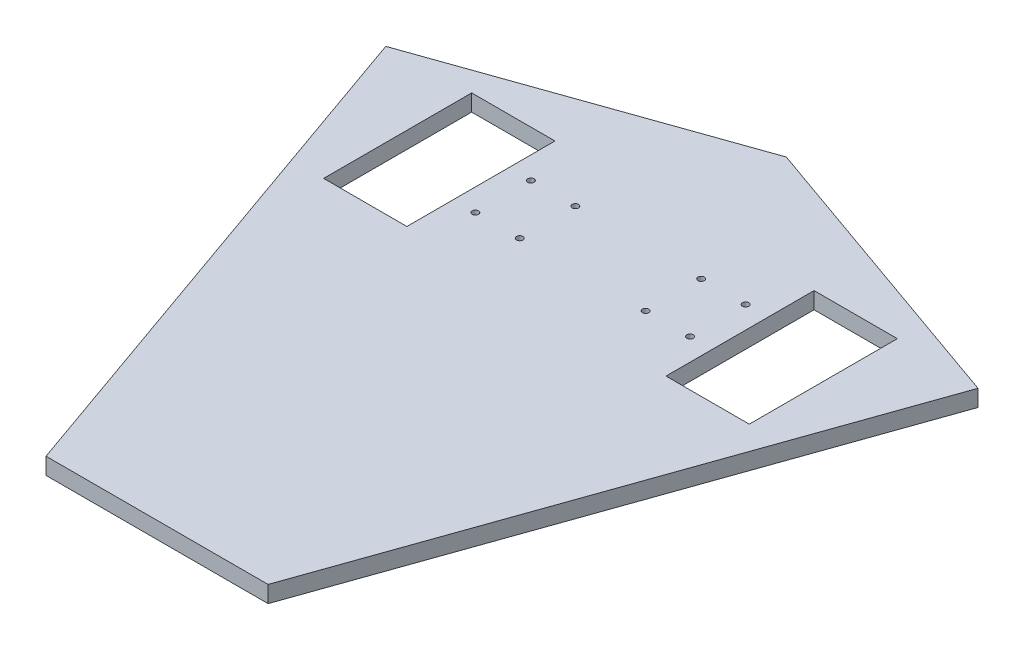
ISO-10303-21;
HEADER;
FILE_DESCRIPTION(('STEP AP214'),'2;1');
FILE_NAME('part.step','',(''),(''),'','','');
FILE_SCHEMA(('AUTOMOTIVE_DESIGN { 1 0 10303 214 1 1 1 1 }'));
ENDSEC;
DATA;
#1=APPLICATION_CONTEXT('core data for automotive mechanical design processes');
#2=APPLICATION_PROTOCOL_DEFINITION('international standard','automotive_design',2000,#1);
#3=PRODUCT_CONTEXT('',#1,'mechanical');
#4=PRODUCT('Part','Part','',(#3));
#5=PRODUCT_RELATED_PRODUCT_CATEGORY('part','',(#4));
#6=PRODUCT_DEFINITION_FORMATION('','',#4);
#7=PRODUCT_DEFINITION_CONTEXT('part definition',#1,'design');
#8=PRODUCT_DEFINITION('design','',#6,#7);
#9=PRODUCT_DEFINITION_SHAPE('','',#8);
#10=(LENGTH_UNIT() NAMED_UNIT(*) SI_UNIT(.MILLI.,.METRE.));
#11=(NAMED_UNIT(*) PLANE_ANGLE_UNIT() SI_UNIT($,.RADIAN.));
#12=(NAMED_UNIT(*) SI_UNIT($,.STERADIAN.) SOLID_ANGLE_UNIT());
#13=UNCERTAINTY_MEASURE_WITH_UNIT(LENGTH_MEASURE(1.E-05),#10,'distance_accuracy_value','');
#14=(GEOMETRIC_REPRESENTATION_CONTEXT(3) GLOBAL_UNCERTAINTY_ASSIGNED_CONTEXT((#13)) GLOBAL_UNIT_ASSIGNED_CONTEXT((#10,
#11,#12)) REPRESENTATION_CONTEXT('',''));
#15=CARTESIAN_POINT('',(0.,0.,0.));
#16=DIRECTION('',(0.,0.,1.));
#17=DIRECTION('',(1.,0.,0.));
#18=AXIS2_PLACEMENT_3D('',#15,#16,#17);
#19=CARTESIAN_POINT('',(0.,0.,0.));
#20=DIRECTION('',(0.,-1.,0.));
#21=DIRECTION('',(0.,0.,-1.));
#22=AXIS2_PLACEMENT_3D('',#19,#20,#21);
#23=PLANE('',#22);
#24=CARTESIAN_POINT('',(58.,0.,-30.));
#25=DIRECTION('',(0.,1.,0.));
#26=DIRECTION('',(0.,0.,1.));
#27=AXIS2_PLACEMENT_3D('',#24,#25,#26);
#28=CIRCLE('',#27,1.69999999999999);
#29=CARTESIAN_POINT('',(58.,0.,-28.3));
#30=VERTEX_POINT('',#29);
#31=EDGE_CURVE('E280',#30,#30,#28,.T.);
#32=ORIENTED_EDGE('',*,*,#31,.F.);
#33=EDGE_LOOP('',(#32));
#34=FACE_BOUND('',#33,.T.);
#35=CARTESIAN_POINT('',(34.,0.,-30.));
#36=DIRECTION('',(0.,1.,0.));
#37=DIRECTION('',(0.,0.,1.));
#38=AXIS2_PLACEMENT_3D('',#35,#36,#37);
#39=CIRCLE('',#38,1.69999999999999);
#40=CARTESIAN_POINT('',(34.,0.,-28.3));
#41=VERTEX_POINT('',#40);
#42=EDGE_CURVE('E274',#41,#41,#39,.T.);
#43=ORIENTED_EDGE('',*,*,#42,.F.);
#44=EDGE_LOOP('',(#43));
#45=FACE_BOUND('',#44,.T.);
#46=CARTESIAN_POINT('',(-58.,0.,-30.));
#47=DIRECTION('',(0.,1.,0.));
#48=DIRECTION('',(0.,0.,1.));
#49=AXIS2_PLACEMENT_3D('',#46,#47,#48);
#50=CIRCLE('',#49,1.69999999999999);
#51=CARTESIAN_POINT('',(-58.,0.,-28.3));
#52=VERTEX_POINT('',#51);
#53=EDGE_CURVE('E271',#52,#52,#50,.T.);
#54=ORIENTED_EDGE('',*,*,#53,.F.);
#55=EDGE_LOOP('',(#54));
#56=FACE_BOUND('',#55,.T.);
#57=CARTESIAN_POINT('',(-58.,0.,0.));
#58=DIRECTION('',(0.,1.,0.));
#59=DIRECTION('',(0.,0.,1.));
#60=AXIS2_PLACEMENT_3D('',#57,#58,#59);
#61=CIRCLE('',#60,1.69999999999999);
#62=CARTESIAN_POINT('',(-58.,0.,1.7));
#63=VERTEX_POINT('',#62);
#64=EDGE_CURVE('E257',#63,#63,#61,.T.);
#65=ORIENTED_EDGE('',*,*,#64,.F.);
#66=EDGE_LOOP('',(#65));
#67=FACE_BOUND('',#66,.T.);
#68=CARTESIAN_POINT('',(-34.,0.,0.));
#69=DIRECTION('',(0.,1.,0.));
#70=DIRECTION('',(0.,0.,1.));
#71=AXIS2_PLACEMENT_3D('',#68,#69,#70);
#72=CIRCLE('',#71,1.69999999999999);
#73=CARTESIAN_POINT('',(-34.,0.,1.69999999999999));
#74=VERTEX_POINT('',#73);
#75=EDGE_CURVE('E248',#74,#74,#72,.T.);
#76=ORIENTED_EDGE('',*,*,#75,.F.);
#77=EDGE_LOOP('',(#76));
#78=FACE_BOUND('',#77,.T.);
#79=DIRECTION('',(-0.943080490559088,0.,-0.332564562644353));
#80=VECTOR('',#79,1.);
#81=CARTESIAN_POINT('',(0.,0.,-110.));
#82=LINE('',#81,#80);
#83=CARTESIAN_POINT('',(160.,0.,-53.5781669160055));
#84=VERTEX_POINT('',#83);
#85=CARTESIAN_POINT('',(0.,0.,-110.));
#86=VERTEX_POINT('',#85);
#87=EDGE_CURVE('E210',#84,#86,#82,.T.);
#88=ORIENTED_EDGE('',*,*,#87,.T.);
#89=DIRECTION('',(-0.943080490559088,0.,0.332564562644353));
#90=VECTOR('',#89,1.);
#91=CARTESIAN_POINT('',(0.,0.,-110.));
#92=LINE('',#91,#90);
#93=CARTESIAN_POINT('',(-160.,0.,-53.5781669160055));
#94=VERTEX_POINT('',#93);
#95=EDGE_CURVE('E230',#86,#94,#92,.T.);
#96=ORIENTED_EDGE('',*,*,#95,.T.);
#97=DIRECTION('',(0.332564562644353,0.,0.943080490559088));
#98=VECTOR('',#97,1.);
#99=CARTESIAN_POINT('',(-160.,0.,-53.5781669160055));
#100=LINE('',#99,#98);
#101=CARTESIAN_POINT('',(-60.,0.,230.));
#102=VERTEX_POINT('',#101);
#103=EDGE_CURVE('E233',#94,#102,#100,.T.);
#104=ORIENTED_EDGE('',*,*,#103,.T.);
#105=DIRECTION('',(1.,0.,0.));
#106=VECTOR('',#105,1.);
#107=CARTESIAN_POINT('',(-60.,0.,230.));
#108=LINE('',#107,#106);
#109=CARTESIAN_POINT('',(60.,0.,230.));
#110=VERTEX_POINT('',#109);
#111=EDGE_CURVE('E236',#102,#110,#108,.T.);
#112=ORIENTED_EDGE('',*,*,#111,.T.);
#113=DIRECTION('',(0.332564562644353,0.,-0.943080490559088));
#114=VECTOR('',#113,1.);
#115=CARTESIAN_POINT('',(160.,0.,-53.5781669160055));
#116=LINE('',#115,#114);
#117=EDGE_CURVE('E215',#110,#84,#116,.T.);
#118=ORIENTED_EDGE('',*,*,#117,.T.);
#119=EDGE_LOOP('',(#88,#96,#104,#112,#118));
#120=FACE_BOUND('',#119,.T.);
#121=DIRECTION('',(1.,0.,0.));
#122=VECTOR('',#121,1.);
#123=CARTESIAN_POINT('',(-115.,0.,25.));
#124=LINE('',#123,#122);
#125=CARTESIAN_POINT('',(-115.,0.,25.));
#126=VERTEX_POINT('',#125);
#127=CARTESIAN_POINT('',(-70.,0.,25.));
#128=VERTEX_POINT('',#127);
#129=EDGE_CURVE('E189',#126,#128,#124,.T.);
#130=ORIENTED_EDGE('',*,*,#129,.F.);
#131=DIRECTION('',(0.,0.,1.));
#132=VECTOR('',#131,1.);
#133=CARTESIAN_POINT('',(-115.,0.,-55.));
#134=LINE('',#133,#132);
#135=CARTESIAN_POINT('',(-115.,0.,-55.));
#136=VERTEX_POINT('',#135);
#137=EDGE_CURVE('E187',#136,#126,#134,.T.);
#138=ORIENTED_EDGE('',*,*,#137,.F.);
#139=DIRECTION('',(-1.,0.,0.));
#140=VECTOR('',#139,1.);
#141=CARTESIAN_POINT('',(-115.,0.,-55.));
#142=LINE('',#141,#140);
#143=CARTESIAN_POINT('',(-70.,0.,-55.));
#144=VERTEX_POINT('',#143);
#145=EDGE_CURVE('E195',#144,#136,#142,.T.);
#146=ORIENTED_EDGE('',*,*,#145,.F.);
#147=DIRECTION('',(0.,0.,-1.));
#148=VECTOR('',#147,1.);
#149=CARTESIAN_POINT('',(-70.,0.,-55.));
#150=LINE('',#149,#148);
#151=EDGE_CURVE('E192',#128,#144,#150,.T.);
#152=ORIENTED_EDGE('',*,*,#151,.F.);
#153=EDGE_LOOP('',(#130,#138,#146,#152));
#154=FACE_BOUND('',#153,.T.);
#155=DIRECTION('',(0.,0.,1.));
#156=VECTOR('',#155,1.);
#157=CARTESIAN_POINT('',(115.,0.,-55.));
#158=LINE('',#157,#156);
#159=CARTESIAN_POINT('',(115.,0.,-55.));
#160=VERTEX_POINT('',#159);
#161=CARTESIAN_POINT('',(115.,0.,25.));
#162=VERTEX_POINT('',#161);
#163=EDGE_CURVE('E72',#160,#162,#158,.T.);
#164=ORIENTED_EDGE('',*,*,#163,.T.);
#165=DIRECTION('',(-1.,0.,0.));
#166=VECTOR('',#165,1.);
#167=CARTESIAN_POINT('',(115.,0.,25.));
#168=LINE('',#167,#166);
#169=CARTESIAN_POINT('',(70.,0.,25.));
#170=VERTEX_POINT('',#169);
#171=EDGE_CURVE('E151',#162,#170,#168,.T.);
#172=ORIENTED_EDGE('',*,*,#171,.T.);
#173=DIRECTION('',(0.,0.,-1.));
#174=VECTOR('',#173,1.);
#175=CARTESIAN_POINT('',(70.,0.,-55.));
#176=LINE('',#175,#174);
#177=CARTESIAN_POINT('',(70.,0.,-55.));
#178=VERTEX_POINT('',#177);
#179=EDGE_CURVE('E170',#170,#178,#176,.T.);
#180=ORIENTED_EDGE('',*,*,#179,.T.);
#181=DIRECTION('',(1.,0.,0.));
#182=VECTOR('',#181,1.);
#183=CARTESIAN_POINT('',(115.,0.,-55.));
#184=LINE('',#183,#182);
#185=EDGE_CURVE('E164',#178,#160,#184,.T.);
#186=ORIENTED_EDGE('',*,*,#185,.T.);
#187=EDGE_LOOP('',(#164,#172,#180,#186));
#188=FACE_BOUND('',#187,.T.);
#189=CARTESIAN_POINT('',(-34.,0.,-30.));
#190=DIRECTION('',(0.,1.,0.));
#191=DIRECTION('',(0.,0.,1.));
#192=AXIS2_PLACEMENT_3D('',#189,#190,#191);
#193=CIRCLE('',#192,1.69999999999999);
#194=CARTESIAN_POINT('',(-34.,0.,-28.3));
#195=VERTEX_POINT('',#194);
#196=EDGE_CURVE('E265',#195,#195,#193,.T.);
#197=ORIENTED_EDGE('',*,*,#196,.F.);
#198=EDGE_LOOP('',(#197));
#199=FACE_BOUND('',#198,.T.);
#200=CARTESIAN_POINT('',(34.,0.,0.));
#201=DIRECTION('',(0.,1.,0.));
#202=DIRECTION('',(0.,0.,1.));
#203=AXIS2_PLACEMENT_3D('',#200,#201,#202);
#204=CIRCLE('',#203,1.69999999999999);
#205=CARTESIAN_POINT('',(34.,0.,1.69999999999999));
#206=VERTEX_POINT('',#205);
#207=EDGE_CURVE('E286',#206,#206,#204,.T.);
#208=ORIENTED_EDGE('',*,*,#207,.F.);
#209=EDGE_LOOP('',(#208));
#210=FACE_BOUND('',#209,.T.);
#211=CARTESIAN_POINT('',(58.,0.,0.));
#212=DIRECTION('',(0.,1.,0.));
#213=DIRECTION('',(0.,0.,1.));
#214=AXIS2_PLACEMENT_3D('',#211,#212,#213);
#215=CIRCLE('',#214,1.69999999999999);
#216=CARTESIAN_POINT('',(58.,0.,1.7));
#217=VERTEX_POINT('',#216);
#218=EDGE_CURVE('E292',#217,#217,#215,.T.);
#219=ORIENTED_EDGE('',*,*,#218,.F.);
#220=EDGE_LOOP('',(#219));
#221=FACE_BOUND('',#220,.T.);
#222=ADVANCED_FACE('F47',(#34,#45,#56,#67,#78,#120,#154,#188,#199,#210,#221),#23,.F.);
#223=CARTESIAN_POINT('',(0.,-9.,0.));
#224=DIRECTION('',(0.,-1.,0.));
#225=DIRECTION('',(0.,0.,-1.));
#226=AXIS2_PLACEMENT_3D('',#223,#224,#225);
#227=PLANE('',#226);
#228=CARTESIAN_POINT('',(58.,-9.,0.));
#229=DIRECTION('',(0.,-1.,0.));
#230=DIRECTION('',(0.,0.,-1.));
#231=AXIS2_PLACEMENT_3D('',#228,#229,#230);
#232=CIRCLE('',#231,1.69999999999999);
#233=CARTESIAN_POINT('',(58.,-9.,-1.69999999999999));
#234=VERTEX_POINT('',#233);
#235=EDGE_CURVE('E289',#234,#234,#232,.T.);
#236=ORIENTED_EDGE('',*,*,#235,.F.);
#237=EDGE_LOOP('',(#236));
#238=FACE_BOUND('',#237,.T.);
#239=CARTESIAN_POINT('',(34.,-9.,0.));
#240=DIRECTION('',(0.,-1.,0.));
#241=DIRECTION('',(0.,0.,-1.));
#242=AXIS2_PLACEMENT_3D('',#239,#240,#241);
#243=CIRCLE('',#242,1.69999999999999);
#244=CARTESIAN_POINT('',(34.,-9.,-1.69999999999999));
#245=VERTEX_POINT('',#244);
#246=EDGE_CURVE('E283',#245,#245,#243,.T.);
#247=ORIENTED_EDGE('',*,*,#246,.F.);
#248=EDGE_LOOP('',(#247));
#249=FACE_BOUND('',#248,.T.);
#250=CARTESIAN_POINT('',(58.,-9.,-30.));
#251=DIRECTION('',(0.,-1.,0.));
#252=DIRECTION('',(0.,0.,-1.));
#253=AXIS2_PLACEMENT_3D('',#250,#251,#252);
#254=CIRCLE('',#253,1.69999999999999);
#255=CARTESIAN_POINT('',(58.,-9.,-31.7));
#256=VERTEX_POINT('',#255);
#257=EDGE_CURVE('E277',#256,#256,#254,.T.);
#258=ORIENTED_EDGE('',*,*,#257,.F.);
#259=EDGE_LOOP('',(#258));
#260=FACE_BOUND('',#259,.T.);
#261=CARTESIAN_POINT('',(34.,-9.,-30.));
#262=DIRECTION('',(0.,-1.,0.));
#263=DIRECTION('',(0.,0.,-1.));
#264=AXIS2_PLACEMENT_3D('',#261,#262,#263);
#265=CIRCLE('',#264,1.69999999999999);
#266=CARTESIAN_POINT('',(34.,-9.,-31.7));
#267=VERTEX_POINT('',#266);
#268=EDGE_CURVE('E51',#267,#267,#265,.T.);
#269=ORIENTED_EDGE('',*,*,#268,.F.);
#270=EDGE_LOOP('',(#269));
#271=FACE_BOUND('',#270,.T.);
#272=CARTESIAN_POINT('',(-58.,-9.,-30.));
#273=DIRECTION('',(0.,-1.,0.));
#274=DIRECTION('',(0.,0.,-1.));
#275=AXIS2_PLACEMENT_3D('',#272,#273,#274);
#276=CIRCLE('',#275,1.69999999999999);
#277=CARTESIAN_POINT('',(-58.,-9.,-31.7));
#278=VERTEX_POINT('',#277);
#279=EDGE_CURVE('E268',#278,#278,#276,.T.);
#280=ORIENTED_EDGE('',*,*,#279,.F.);
#281=EDGE_LOOP('',(#280));
#282=FACE_BOUND('',#281,.T.);
#283=CARTESIAN_POINT('',(-34.,-9.,-30.));
#284=DIRECTION('',(0.,-1.,0.));
#285=DIRECTION('',(0.,0.,-1.));
#286=AXIS2_PLACEMENT_3D('',#283,#284,#285);
#287=CIRCLE('',#286,1.69999999999999);
#288=CARTESIAN_POINT('',(-34.,-9.,-31.7));
#289=VERTEX_POINT('',#288);
#290=EDGE_CURVE('E262',#289,#289,#287,.T.);
#291=ORIENTED_EDGE('',*,*,#290,.F.);
#292=EDGE_LOOP('',(#291));
#293=FACE_BOUND('',#292,.T.);
#294=CARTESIAN_POINT('',(-58.,-9.,0.));
#295=DIRECTION('',(0.,-1.,0.));
#296=DIRECTION('',(0.,0.,-1.));
#297=AXIS2_PLACEMENT_3D('',#294,#295,#296);
#298=CIRCLE('',#297,1.69999999999999);
#299=CARTESIAN_POINT('',(-58.,-9.,-1.69999999999999));
#300=VERTEX_POINT('',#299);
#301=EDGE_CURVE('E252',#300,#300,#298,.T.);
#302=ORIENTED_EDGE('',*,*,#301,.F.);
#303=EDGE_LOOP('',(#302));
#304=FACE_BOUND('',#303,.T.);
#305=CARTESIAN_POINT('',(-34.,-9.,0.));
#306=DIRECTION('',(0.,-1.,0.));
#307=DIRECTION('',(0.,0.,-1.));
#308=AXIS2_PLACEMENT_3D('',#305,#306,#307);
#309=CIRCLE('',#308,1.69999999999999);
#310=CARTESIAN_POINT('',(-34.,-9.,-1.69999999999999));
#311=VERTEX_POINT('',#310);
#312=EDGE_CURVE('E246',#311,#311,#309,.T.);
#313=ORIENTED_EDGE('',*,*,#312,.F.);
#314=EDGE_LOOP('',(#313));
#315=FACE_BOUND('',#314,.T.);
#316=DIRECTION('',(0.,0.,1.));
#317=VECTOR('',#316,1.);
#318=CARTESIAN_POINT('',(-115.,-9.,-55.));
#319=LINE('',#318,#317);
#320=CARTESIAN_POINT('',(-115.,-9.,-55.));
#321=VERTEX_POINT('',#320);
#322=CARTESIAN_POINT('',(-115.,-9.,25.));
#323=VERTEX_POINT('',#322);
#324=EDGE_CURVE('E184',#321,#323,#319,.T.);
#325=ORIENTED_EDGE('',*,*,#324,.T.);
#326=DIRECTION('',(1.,0.,0.));
#327=VECTOR('',#326,1.);
#328=CARTESIAN_POINT('',(-115.,-9.,25.));
#329=LINE('',#328,#327);
#330=CARTESIAN_POINT('',(-70.,-9.,25.));
#331=VERTEX_POINT('',#330);
#332=EDGE_CURVE('E201',#323,#331,#329,.T.);
#333=ORIENTED_EDGE('',*,*,#332,.T.);
#334=DIRECTION('',(0.,0.,-1.));
#335=VECTOR('',#334,1.);
#336=CARTESIAN_POINT('',(-70.,-9.,-55.));
#337=LINE('',#336,#335);
#338=CARTESIAN_POINT('',(-70.,-9.,-55.));
#339=VERTEX_POINT('',#338);
#340=EDGE_CURVE('E157',#331,#339,#337,.T.);
#341=ORIENTED_EDGE('',*,*,#340,.T.);
#342=DIRECTION('',(-1.,0.,0.));
#343=VECTOR('',#342,1.);
#344=CARTESIAN_POINT('',(-115.,-9.,-55.));
#345=LINE('',#344,#343);
#346=EDGE_CURVE('E181',#339,#321,#345,.T.);
#347=ORIENTED_EDGE('',*,*,#346,.T.);
#348=EDGE_LOOP('',(#325,#333,#341,#347));
#349=FACE_BOUND('',#348,.T.);
#350=DIRECTION('',(-0.943080490559088,0.,-0.332564562644353));
#351=VECTOR('',#350,1.);
#352=CARTESIAN_POINT('',(0.,-9.,-110.));
#353=LINE('',#352,#351);
#354=CARTESIAN_POINT('',(160.,-9.,-53.5781669160055));
#355=VERTEX_POINT('',#354);
#356=CARTESIAN_POINT('',(0.,-9.,-110.));
#357=VERTEX_POINT('',#356);
#358=EDGE_CURVE('E211',#355,#357,#353,.T.);
#359=ORIENTED_EDGE('',*,*,#358,.F.);
#360=DIRECTION('',(0.332564562644353,0.,-0.943080490559088));
#361=VECTOR('',#360,1.);
#362=CARTESIAN_POINT('',(160.,-9.,-53.5781669160055));
#363=LINE('',#362,#361);
#364=CARTESIAN_POINT('',(60.,-9.,230.));
#365=VERTEX_POINT('',#364);
#366=EDGE_CURVE('E224',#365,#355,#363,.T.);
#367=ORIENTED_EDGE('',*,*,#366,.F.);
#368=DIRECTION('',(1.,0.,0.));
#369=VECTOR('',#368,1.);
#370=CARTESIAN_POINT('',(-60.,-9.,230.));
#371=LINE('',#370,#369);
#372=CARTESIAN_POINT('',(-60.,-9.,230.));
#373=VERTEX_POINT('',#372);
#374=EDGE_CURVE('E221',#373,#365,#371,.T.);
#375=ORIENTED_EDGE('',*,*,#374,.F.);
#376=DIRECTION('',(0.332564562644353,0.,0.943080490559088));
#377=VECTOR('',#376,1.);
#378=CARTESIAN_POINT('',(-160.,-9.,-53.5781669160055));
#379=LINE('',#378,#377);
#380=CARTESIAN_POINT('',(-160.,-9.,-53.5781669160055));
#381=VERTEX_POINT('',#380);
#382=EDGE_CURVE('E218',#381,#373,#379,.T.);
#383=ORIENTED_EDGE('',*,*,#382,.F.);
#384=DIRECTION('',(-0.943080490559088,0.,0.332564562644353));
#385=VECTOR('',#384,1.);
#386=CARTESIAN_POINT('',(0.,-9.,-110.));
#387=LINE('',#386,#385);
#388=EDGE_CURVE('E214',#357,#381,#387,.T.);
#389=ORIENTED_EDGE('',*,*,#388,.F.);
#390=EDGE_LOOP('',(#359,#367,#375,#383,#389));
#391=FACE_BOUND('',#390,.T.);
#392=DIRECTION('',(-1.,0.,0.));
#393=VECTOR('',#392,1.);
#394=CARTESIAN_POINT('',(115.,-9.,25.));
#395=LINE('',#394,#393);
#396=CARTESIAN_POINT('',(115.,-9.,25.));
#397=VERTEX_POINT('',#396);
#398=CARTESIAN_POINT('',(70.,-9.,25.));
#399=VERTEX_POINT('',#398);
#400=EDGE_CURVE('E162',#397,#399,#395,.T.);
#401=ORIENTED_EDGE('',*,*,#400,.F.);
#402=DIRECTION('',(0.,0.,1.));
#403=VECTOR('',#402,1.);
#404=CARTESIAN_POINT('',(115.,-9.,-55.));
#405=LINE('',#404,#403);
#406=CARTESIAN_POINT('',(115.,-9.,-55.));
#407=VERTEX_POINT('',#406);
#408=EDGE_CURVE('E145',#407,#397,#405,.T.);
#409=ORIENTED_EDGE('',*,*,#408,.F.);
#410=DIRECTION('',(1.,0.,0.));
#411=VECTOR('',#410,1.);
#412=CARTESIAN_POINT('',(115.,-9.,-55.));
#413=LINE('',#412,#411);
#414=CARTESIAN_POINT('',(70.,-9.,-55.));
#415=VERTEX_POINT('',#414);
#416=EDGE_CURVE('E154',#415,#407,#413,.T.);
#417=ORIENTED_EDGE('',*,*,#416,.F.);
#418=DIRECTION('',(0.,0.,-1.));
#419=VECTOR('',#418,1.);
#420=CARTESIAN_POINT('',(70.,-9.,-55.));
#421=LINE('',#420,#419);
#422=EDGE_CURVE('E64',#399,#415,#421,.T.);
#423=ORIENTED_EDGE('',*,*,#422,.F.);
#424=EDGE_LOOP('',(#401,#409,#417,#423));
#425=FACE_BOUND('',#424,.T.);
#426=ADVANCED_FACE('F160',(#238,#249,#260,#271,#282,#293,#304,#315,#349,#391,#425),#227,.T.);
#427=CARTESIAN_POINT('',(0.,-9.,-110.));
#428=DIRECTION('',(0.332564562644353,0.,-0.943080490559088));
#429=DIRECTION('',(-0.943080490559088,0.,-0.332564562644353));
#430=AXIS2_PLACEMENT_3D('',#427,#428,#429);
#431=PLANE('',#430);
#432=ORIENTED_EDGE('',*,*,#87,.F.);
#433=DIRECTION('',(0.,1.,0.));
#434=VECTOR('',#433,1.);
#435=CARTESIAN_POINT('',(160.,-9.,-53.5781669160055));
#436=LINE('',#435,#434);
#437=EDGE_CURVE('E13',#355,#84,#436,.T.);
#438=ORIENTED_EDGE('',*,*,#437,.F.);
#439=ORIENTED_EDGE('',*,*,#358,.T.);
#440=DIRECTION('',(0.,1.,0.));
#441=VECTOR('',#440,1.);
#442=CARTESIAN_POINT('',(0.,-9.,-110.));
#443=LINE('',#442,#441);
#444=EDGE_CURVE('E227',#357,#86,#443,.T.);
#445=ORIENTED_EDGE('',*,*,#444,.T.);
#446=EDGE_LOOP('',(#432,#438,#439,#445));
#447=FACE_BOUND('',#446,.T.);
#448=ADVANCED_FACE('F49',(#447),#431,.T.);
#449=CARTESIAN_POINT('',(160.,-9.,-53.5781669160055));
#450=DIRECTION('',(0.943080490559088,0.,0.332564562644353));
#451=DIRECTION('',(0.332564562644353,0.,-0.943080490559088));
#452=AXIS2_PLACEMENT_3D('',#449,#450,#451);
#453=PLANE('',#452);
#454=ORIENTED_EDGE('',*,*,#117,.F.);
#455=DIRECTION('',(0.,1.,0.));
#456=VECTOR('',#455,1.);
#457=CARTESIAN_POINT('',(60.,-9.,230.));
#458=LINE('',#457,#456);
#459=EDGE_CURVE('E56',#365,#110,#458,.T.);
#460=ORIENTED_EDGE('',*,*,#459,.F.);
#461=ORIENTED_EDGE('',*,*,#366,.T.);
#462=ORIENTED_EDGE('',*,*,#437,.T.);
#463=EDGE_LOOP('',(#454,#460,#461,#462));
#464=FACE_BOUND('',#463,.T.);
#465=ADVANCED_FACE('F310',(#464),#453,.T.);
#466=CARTESIAN_POINT('',(-60.,-9.,230.));
#467=DIRECTION('',(0.,0.,1.));
#468=DIRECTION('',(1.,0.,0.));
#469=AXIS2_PLACEMENT_3D('',#466,#467,#468);
#470=PLANE('',#469);
#471=ORIENTED_EDGE('',*,*,#111,.F.);
#472=DIRECTION('',(0.,1.,0.));
#473=VECTOR('',#472,1.);
#474=CARTESIAN_POINT('',(-60.,-9.,230.));
#475=LINE('',#474,#473);
#476=EDGE_CURVE('E242',#373,#102,#475,.T.);
#477=ORIENTED_EDGE('',*,*,#476,.F.);
#478=ORIENTED_EDGE('',*,*,#374,.T.);
#479=ORIENTED_EDGE('',*,*,#459,.T.);
#480=EDGE_LOOP('',(#471,#477,#478,#479));
#481=FACE_BOUND('',#480,.T.);
#482=ADVANCED_FACE('F313',(#481),#470,.T.);
#483=CARTESIAN_POINT('',(-160.,-9.,-53.5781669160055));
#484=DIRECTION('',(-0.943080490559088,0.,0.332564562644353));
#485=DIRECTION('',(0.332564562644353,0.,0.943080490559088));
#486=AXIS2_PLACEMENT_3D('',#483,#484,#485);
#487=PLANE('',#486);
#488=ORIENTED_EDGE('',*,*,#103,.F.);
#489=DIRECTION('',(0.,1.,0.));
#490=VECTOR('',#489,1.);
#491=CARTESIAN_POINT('',(-160.,-9.,-53.5781669160055));
#492=LINE('',#491,#490);
#493=EDGE_CURVE('E244',#381,#94,#492,.T.);
#494=ORIENTED_EDGE('',*,*,#493,.F.);
#495=ORIENTED_EDGE('',*,*,#382,.T.);
#496=ORIENTED_EDGE('',*,*,#476,.T.);
#497=EDGE_LOOP('',(#488,#494,#495,#496));
#498=FACE_BOUND('',#497,.T.);
#499=ADVANCED_FACE('F317',(#498),#487,.T.);
#500=CARTESIAN_POINT('',(0.,-9.,-110.));
#501=DIRECTION('',(-0.332564562644353,0.,-0.943080490559088));
#502=DIRECTION('',(-0.943080490559088,0.,0.332564562644353));
#503=AXIS2_PLACEMENT_3D('',#500,#501,#502);
#504=PLANE('',#503);
#505=ORIENTED_EDGE('',*,*,#95,.F.);
#506=ORIENTED_EDGE('',*,*,#444,.F.);
#507=ORIENTED_EDGE('',*,*,#388,.T.);
#508=ORIENTED_EDGE('',*,*,#493,.T.);
#509=EDGE_LOOP('',(#505,#506,#507,#508));
#510=FACE_BOUND('',#509,.T.);
#511=ADVANCED_FACE('F320',(#510),#504,.T.);
#512=CARTESIAN_POINT('',(-115.,-9.001,-55.));
#513=DIRECTION('',(-1.,0.,0.));
#514=DIRECTION('',(0.,0.,1.));
#515=AXIS2_PLACEMENT_3D('',#512,#513,#514);
#516=PLANE('',#515);
#517=DIRECTION('',(0.,1.,0.));
#518=VECTOR('',#517,1.);
#519=CARTESIAN_POINT('',(-115.,-9.001,-55.));
#520=LINE('',#519,#518);
#521=EDGE_CURVE('E199',#321,#136,#520,.T.);
#522=ORIENTED_EDGE('',*,*,#521,.T.);
#523=ORIENTED_EDGE('',*,*,#137,.T.);
#524=DIRECTION('',(0.,1.,0.));
#525=VECTOR('',#524,1.);
#526=CARTESIAN_POINT('',(-115.,-9.001,25.));
#527=LINE('',#526,#525);
#528=EDGE_CURVE('E198',#323,#126,#527,.T.);
#529=ORIENTED_EDGE('',*,*,#528,.F.);
#530=ORIENTED_EDGE('',*,*,#324,.F.);
#531=EDGE_LOOP('',(#522,#523,#529,#530));
#532=FACE_BOUND('',#531,.T.);
#533=ADVANCED_FACE('F323',(#532),#516,.F.);
#534=CARTESIAN_POINT('',(-115.,-9.001,-55.));
#535=DIRECTION('',(0.,0.,-1.));
#536=DIRECTION('',(-1.,0.,0.));
#537=AXIS2_PLACEMENT_3D('',#534,#535,#536);
#538=PLANE('',#537);
#539=DIRECTION('',(0.,1.,0.));
#540=VECTOR('',#539,1.);
#541=CARTESIAN_POINT('',(-70.,-9.001,-55.));
#542=LINE('',#541,#540);
#543=EDGE_CURVE('E202',#339,#144,#542,.T.);
#544=ORIENTED_EDGE('',*,*,#543,.T.);
#545=ORIENTED_EDGE('',*,*,#145,.T.);
#546=ORIENTED_EDGE('',*,*,#521,.F.);
#547=ORIENTED_EDGE('',*,*,#346,.F.);
#548=EDGE_LOOP('',(#544,#545,#546,#547));
#549=FACE_BOUND('',#548,.T.);
#550=ADVANCED_FACE('F328',(#549),#538,.F.);
#551=CARTESIAN_POINT('',(-70.,-9.001,-55.));
#552=DIRECTION('',(1.,0.,0.));
#553=DIRECTION('',(0.,0.,-1.));
#554=AXIS2_PLACEMENT_3D('',#551,#552,#553);
#555=PLANE('',#554);
#556=DIRECTION('',(0.,1.,0.));
#557=VECTOR('',#556,1.);
#558=CARTESIAN_POINT('',(-70.,-9.001,25.));
#559=LINE('',#558,#557);
#560=EDGE_CURVE('E204',#331,#128,#559,.T.);
#561=ORIENTED_EDGE('',*,*,#560,.T.);
#562=ORIENTED_EDGE('',*,*,#151,.T.);
#563=ORIENTED_EDGE('',*,*,#543,.F.);
#564=ORIENTED_EDGE('',*,*,#340,.F.);
#565=EDGE_LOOP('',(#561,#562,#563,#564));
#566=FACE_BOUND('',#565,.T.);
#567=ADVANCED_FACE('F380',(#566),#555,.F.);
#568=CARTESIAN_POINT('',(-115.,-9.001,25.));
#569=DIRECTION('',(0.,0.,1.));
#570=DIRECTION('',(1.,0.,0.));
#571=AXIS2_PLACEMENT_3D('',#568,#569,#570);
#572=PLANE('',#571);
#573=ORIENTED_EDGE('',*,*,#528,.T.);
#574=ORIENTED_EDGE('',*,*,#129,.T.);
#575=ORIENTED_EDGE('',*,*,#560,.F.);
#576=ORIENTED_EDGE('',*,*,#332,.F.);
#577=EDGE_LOOP('',(#573,#574,#575,#576));
#578=FACE_BOUND('',#577,.T.);
#579=ADVANCED_FACE('F390',(#578),#572,.F.);
#580=CARTESIAN_POINT('',(115.,-9.001,-55.));
#581=DIRECTION('',(-1.,0.,0.));
#582=DIRECTION('',(0.,0.,1.));
#583=AXIS2_PLACEMENT_3D('',#580,#581,#582);
#584=PLANE('',#583);
#585=ORIENTED_EDGE('',*,*,#408,.T.);
#586=DIRECTION('',(0.,1.,0.));
#587=VECTOR('',#586,1.);
#588=CARTESIAN_POINT('',(115.,-9.001,25.));
#589=LINE('',#588,#587);
#590=EDGE_CURVE('E158',#397,#162,#589,.T.);
#591=ORIENTED_EDGE('',*,*,#590,.T.);
#592=ORIENTED_EDGE('',*,*,#163,.F.);
#593=DIRECTION('',(0.,1.,0.));
#594=VECTOR('',#593,1.);
#595=CARTESIAN_POINT('',(115.,-9.001,-55.));
#596=LINE('',#595,#594);
#597=EDGE_CURVE('E141',#407,#160,#596,.T.);
#598=ORIENTED_EDGE('',*,*,#597,.F.);
#599=EDGE_LOOP('',(#585,#591,#592,#598));
#600=FACE_BOUND('',#599,.T.);
#601=ADVANCED_FACE('F143',(#600),#584,.T.);
#602=CARTESIAN_POINT('',(115.,-9.001,25.));
#603=DIRECTION('',(0.,0.,-1.));
#604=DIRECTION('',(-1.,0.,0.));
#605=AXIS2_PLACEMENT_3D('',#602,#603,#604);
#606=PLANE('',#605);
#607=ORIENTED_EDGE('',*,*,#400,.T.);
#608=DIRECTION('',(0.,1.,0.));
#609=VECTOR('',#608,1.);
#610=CARTESIAN_POINT('',(70.,-9.001,25.));
#611=LINE('',#610,#609);
#612=EDGE_CURVE('E176',#399,#170,#611,.T.);
#613=ORIENTED_EDGE('',*,*,#612,.T.);
#614=ORIENTED_EDGE('',*,*,#171,.F.);
#615=ORIENTED_EDGE('',*,*,#590,.F.);
#616=EDGE_LOOP('',(#607,#613,#614,#615));
#617=FACE_BOUND('',#616,.T.);
#618=ADVANCED_FACE('F410',(#617),#606,.T.);
#619=CARTESIAN_POINT('',(70.,-9.001,-55.));
#620=DIRECTION('',(1.,0.,0.));
#621=DIRECTION('',(0.,0.,-1.));
#622=AXIS2_PLACEMENT_3D('',#619,#620,#621);
#623=PLANE('',#622);
#624=ORIENTED_EDGE('',*,*,#422,.T.);
#625=DIRECTION('',(0.,1.,0.));
#626=VECTOR('',#625,1.);
#627=CARTESIAN_POINT('',(70.,-9.001,-55.));
#628=LINE('',#627,#626);
#629=EDGE_CURVE('E150',#415,#178,#628,.T.);
#630=ORIENTED_EDGE('',*,*,#629,.T.);
#631=ORIENTED_EDGE('',*,*,#179,.F.);
#632=ORIENTED_EDGE('',*,*,#612,.F.);
#633=EDGE_LOOP('',(#624,#630,#631,#632));
#634=FACE_BOUND('',#633,.T.);
#635=ADVANCED_FACE('F419',(#634),#623,.T.);
#636=CARTESIAN_POINT('',(115.,-9.001,-55.));
#637=DIRECTION('',(0.,0.,1.));
#638=DIRECTION('',(1.,0.,0.));
#639=AXIS2_PLACEMENT_3D('',#636,#637,#638);
#640=PLANE('',#639);
#641=ORIENTED_EDGE('',*,*,#416,.T.);
#642=ORIENTED_EDGE('',*,*,#597,.T.);
#643=ORIENTED_EDGE('',*,*,#185,.F.);
#644=ORIENTED_EDGE('',*,*,#629,.F.);
#645=EDGE_LOOP('',(#641,#642,#643,#644));
#646=FACE_BOUND('',#645,.T.);
#647=ADVANCED_FACE('F155',(#646),#640,.T.);
#648=CARTESIAN_POINT('',(-34.,0.,0.));
#649=DIRECTION('',(0.,1.,0.));
#650=DIRECTION('',(0.,0.,1.));
#651=AXIS2_PLACEMENT_3D('',#648,#649,#650);
#652=CYLINDRICAL_SURFACE('',#651,1.69999999999999);
#653=ORIENTED_EDGE('',*,*,#312,.T.);
#654=EDGE_LOOP('',(#653));
#655=FACE_BOUND('',#654,.T.);
#656=ORIENTED_EDGE('',*,*,#75,.T.);
#657=EDGE_LOOP('',(#656));
#658=FACE_BOUND('',#657,.T.);
#659=ADVANCED_FACE('F437',(#655,#658),#652,.F.);
#660=CARTESIAN_POINT('',(-58.,0.,0.));
#661=DIRECTION('',(0.,1.,0.));
#662=DIRECTION('',(0.,0.,1.));
#663=AXIS2_PLACEMENT_3D('',#660,#661,#662);
#664=CYLINDRICAL_SURFACE('',#663,1.69999999999999);
#665=ORIENTED_EDGE('',*,*,#301,.T.);
#666=EDGE_LOOP('',(#665));
#667=FACE_BOUND('',#666,.T.);
#668=ORIENTED_EDGE('',*,*,#64,.T.);
#669=EDGE_LOOP('',(#668));
#670=FACE_BOUND('',#669,.T.);
#671=ADVANCED_FACE('F446',(#667,#670),#664,.F.);
#672=CARTESIAN_POINT('',(-34.,0.,-30.));
#673=DIRECTION('',(0.,1.,0.));
#674=DIRECTION('',(0.,0.,1.));
#675=AXIS2_PLACEMENT_3D('',#672,#673,#674);
#676=CYLINDRICAL_SURFACE('',#675,1.69999999999999);
#677=ORIENTED_EDGE('',*,*,#290,.T.);
#678=EDGE_LOOP('',(#677));
#679=FACE_BOUND('',#678,.T.);
#680=ORIENTED_EDGE('',*,*,#196,.T.);
#681=EDGE_LOOP('',(#680));
#682=FACE_BOUND('',#681,.T.);
#683=ADVANCED_FACE('F455',(#679,#682),#676,.F.);
#684=CARTESIAN_POINT('',(-58.,0.,-30.));
#685=DIRECTION('',(0.,1.,0.));
#686=DIRECTION('',(0.,0.,1.));
#687=AXIS2_PLACEMENT_3D('',#684,#685,#686);
#688=CYLINDRICAL_SURFACE('',#687,1.69999999999999);
#689=ORIENTED_EDGE('',*,*,#279,.T.);
#690=EDGE_LOOP('',(#689));
#691=FACE_BOUND('',#690,.T.);
#692=ORIENTED_EDGE('',*,*,#53,.T.);
#693=EDGE_LOOP('',(#692));
#694=FACE_BOUND('',#693,.T.);
#695=ADVANCED_FACE('F465',(#691,#694),#688,.F.);
#696=CARTESIAN_POINT('',(34.,0.,-30.));
#697=DIRECTION('',(0.,1.,0.));
#698=DIRECTION('',(0.,0.,1.));
#699=AXIS2_PLACEMENT_3D('',#696,#697,#698);
#700=CYLINDRICAL_SURFACE('',#699,1.69999999999999);
#701=ORIENTED_EDGE('',*,*,#268,.T.);
#702=EDGE_LOOP('',(#701));
#703=FACE_BOUND('',#702,.T.);
#704=ORIENTED_EDGE('',*,*,#42,.T.);
#705=EDGE_LOOP('',(#704));
#706=FACE_BOUND('',#705,.T.);
#707=ADVANCED_FACE('F474',(#703,#706),#700,.F.);
#708=CARTESIAN_POINT('',(58.,0.,-30.));
#709=DIRECTION('',(0.,1.,0.));
#710=DIRECTION('',(0.,0.,1.));
#711=AXIS2_PLACEMENT_3D('',#708,#709,#710);
#712=CYLINDRICAL_SURFACE('',#711,1.69999999999999);
#713=ORIENTED_EDGE('',*,*,#257,.T.);
#714=EDGE_LOOP('',(#713));
#715=FACE_BOUND('',#714,.T.);
#716=ORIENTED_EDGE('',*,*,#31,.T.);
#717=EDGE_LOOP('',(#716));
#718=FACE_BOUND('',#717,.T.);
#719=ADVANCED_FACE('F492',(#715,#718),#712,.F.);
#720=CARTESIAN_POINT('',(34.,0.,0.));
#721=DIRECTION('',(0.,1.,0.));
#722=DIRECTION('',(0.,0.,1.));
#723=AXIS2_PLACEMENT_3D('',#720,#721,#722);
#724=CYLINDRICAL_SURFACE('',#723,1.69999999999999);
#725=ORIENTED_EDGE('',*,*,#246,.T.);
#726=EDGE_LOOP('',(#725));
#727=FACE_BOUND('',#726,.T.);
#728=ORIENTED_EDGE('',*,*,#207,.T.);
#729=EDGE_LOOP('',(#728));
#730=FACE_BOUND('',#729,.T.);
#731=ADVANCED_FACE('F502',(#727,#730),#724,.F.);
#732=CARTESIAN_POINT('',(58.,0.,0.));
#733=DIRECTION('',(0.,1.,0.));
#734=DIRECTION('',(0.,0.,1.));
#735=AXIS2_PLACEMENT_3D('',#732,#733,#734);
#736=CYLINDRICAL_SURFACE('',#735,1.69999999999999);
#737=ORIENTED_EDGE('',*,*,#235,.T.);
#738=EDGE_LOOP('',(#737));
#739=FACE_BOUND('',#738,.T.);
#740=ORIENTED_EDGE('',*,*,#218,.T.);
#741=EDGE_LOOP('',(#740));
#742=FACE_BOUND('',#741,.T.);
#743=ADVANCED_FACE('F296',(#739,#742),#736,.F.);
#744=CLOSED_SHELL('',(#222,#426,#448,#465,#482,#499,#511,#533,#550,#567,#579,#601,#618,#635,
#647,#659,#671,#683,#695,#707,#719,#731,#743));
#745=MANIFOLD_SOLID_BREP('B2',#744);
#746=ADVANCED_BREP_SHAPE_REPRESENTATION('',(#18,#745),#14);
#747=SHAPE_DEFINITION_REPRESENTATION(#9,#746);
ENDSEC;
END-ISO-10303-21;
